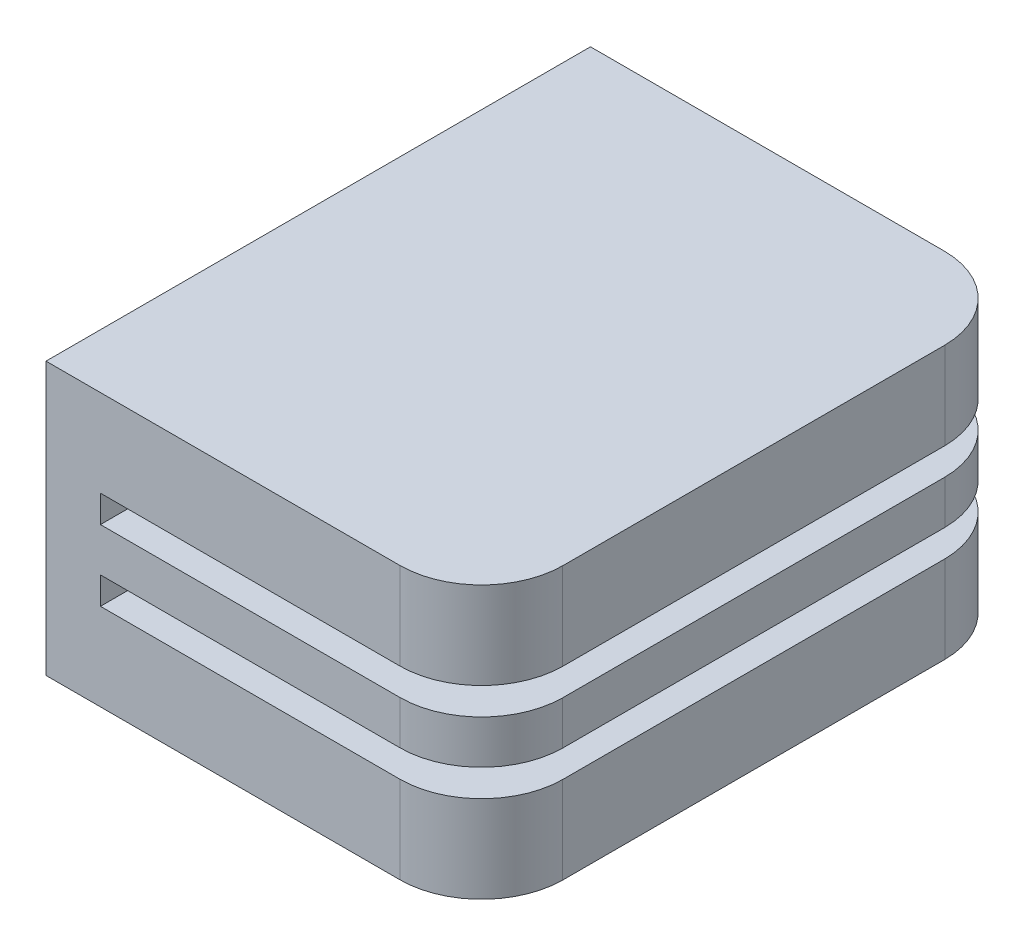
ISO-10303-21;
HEADER;
FILE_DESCRIPTION(('STEP AP214'),'2;1');
FILE_NAME('part.step','',(''),(''),'','','');
FILE_SCHEMA(('AUTOMOTIVE_DESIGN { 1 0 10303 214 1 1 1 1 }'));
ENDSEC;
DATA;
#1=APPLICATION_CONTEXT('core data for automotive mechanical design processes');
#2=APPLICATION_PROTOCOL_DEFINITION('international standard','automotive_design',2000,#1);
#3=PRODUCT_CONTEXT('',#1,'mechanical');
#4=PRODUCT('Part','Part','',(#3));
#5=PRODUCT_RELATED_PRODUCT_CATEGORY('part','',(#4));
#6=PRODUCT_DEFINITION_FORMATION('','',#4);
#7=PRODUCT_DEFINITION_CONTEXT('part definition',#1,'design');
#8=PRODUCT_DEFINITION('design','',#6,#7);
#9=PRODUCT_DEFINITION_SHAPE('','',#8);
#10=(LENGTH_UNIT() NAMED_UNIT(*) SI_UNIT(.MILLI.,.METRE.));
#11=(NAMED_UNIT(*) PLANE_ANGLE_UNIT() SI_UNIT($,.RADIAN.));
#12=(NAMED_UNIT(*) SI_UNIT($,.STERADIAN.) SOLID_ANGLE_UNIT());
#13=UNCERTAINTY_MEASURE_WITH_UNIT(LENGTH_MEASURE(1.E-05),#10,'distance_accuracy_value','');
#14=(GEOMETRIC_REPRESENTATION_CONTEXT(3) GLOBAL_UNCERTAINTY_ASSIGNED_CONTEXT((#13)) GLOBAL_UNIT_ASSIGNED_CONTEXT((#10,
#11,#12)) REPRESENTATION_CONTEXT('',''));
#15=CARTESIAN_POINT('',(0.,0.,0.));
#16=DIRECTION('',(0.,0.,1.));
#17=DIRECTION('',(1.,0.,0.));
#18=AXIS2_PLACEMENT_3D('',#15,#16,#17);
#19=CARTESIAN_POINT('',(4.,-5.,-5.));
#20=DIRECTION('',(0.,0.,-1.));
#21=DIRECTION('',(-1.,0.,0.));
#22=AXIS2_PLACEMENT_3D('',#19,#20,#21);
#23=PLANE('',#22);
#24=DIRECTION('',(-1.,0.,0.));
#25=VECTOR('',#24,1.);
#26=CARTESIAN_POINT('',(4.,0.,-5.));
#27=LINE('',#26,#25);
#28=CARTESIAN_POINT('',(2.50003341576897,0.,-5.));
#29=VERTEX_POINT('',#28);
#30=CARTESIAN_POINT('',(-4.,0.,-5.));
#31=VERTEX_POINT('',#30);
#32=EDGE_CURVE('E185',#29,#31,#27,.T.);
#33=ORIENTED_EDGE('',*,*,#32,.F.);
#34=DIRECTION('',(0.,1.,0.));
#35=VECTOR('',#34,1.);
#36=CARTESIAN_POINT('',(2.50003341576897,-5.,-5.));
#37=LINE('',#36,#35);
#38=CARTESIAN_POINT('',(2.50003341576897,-1.6,-5.));
#39=VERTEX_POINT('',#38);
#40=EDGE_CURVE('E291',#39,#29,#37,.T.);
#41=ORIENTED_EDGE('',*,*,#40,.F.);
#42=DIRECTION('',(1.,0.,0.));
#43=VECTOR('',#42,1.);
#44=CARTESIAN_POINT('',(4.,-1.6,-5.));
#45=LINE('',#44,#43);
#46=CARTESIAN_POINT('',(-3.,-1.6,-5.));
#47=VERTEX_POINT('',#46);
#48=EDGE_CURVE('E251',#47,#39,#45,.T.);
#49=ORIENTED_EDGE('',*,*,#48,.F.);
#50=DIRECTION('',(0.,1.,0.));
#51=VECTOR('',#50,1.);
#52=CARTESIAN_POINT('',(-3.,-1.6,-5.));
#53=LINE('',#52,#51);
#54=CARTESIAN_POINT('',(-3.,-2.1,-5.));
#55=VERTEX_POINT('',#54);
#56=EDGE_CURVE('E248',#55,#47,#53,.T.);
#57=ORIENTED_EDGE('',*,*,#56,.F.);
#58=DIRECTION('',(-1.,0.,0.));
#59=VECTOR('',#58,1.);
#60=CARTESIAN_POINT('',(-3.,-2.1,-5.));
#61=LINE('',#60,#59);
#62=CARTESIAN_POINT('',(2.50003341576897,-2.1,-5.));
#63=VERTEX_POINT('',#62);
#64=EDGE_CURVE('E246',#63,#55,#61,.T.);
#65=ORIENTED_EDGE('',*,*,#64,.F.);
#66=CARTESIAN_POINT('',(2.50003341576897,-2.9,-5.));
#67=VERTEX_POINT('',#66);
#68=EDGE_CURVE('E294',#67,#63,#37,.T.);
#69=ORIENTED_EDGE('',*,*,#68,.F.);
#70=DIRECTION('',(1.,0.,0.));
#71=VECTOR('',#70,1.);
#72=CARTESIAN_POINT('',(-3.,-2.9,-5.));
#73=LINE('',#72,#71);
#74=CARTESIAN_POINT('',(-3.,-2.9,-5.));
#75=VERTEX_POINT('',#74);
#76=EDGE_CURVE('E225',#75,#67,#73,.T.);
#77=ORIENTED_EDGE('',*,*,#76,.F.);
#78=DIRECTION('',(0.,1.,0.));
#79=VECTOR('',#78,1.);
#80=CARTESIAN_POINT('',(-3.,-3.4,-5.));
#81=LINE('',#80,#79);
#82=CARTESIAN_POINT('',(-3.,-3.4,-5.));
#83=VERTEX_POINT('',#82);
#84=EDGE_CURVE('E224',#83,#75,#81,.T.);
#85=ORIENTED_EDGE('',*,*,#84,.F.);
#86=DIRECTION('',(-1.,0.,0.));
#87=VECTOR('',#86,1.);
#88=CARTESIAN_POINT('',(4.,-3.4,-5.));
#89=LINE('',#88,#87);
#90=CARTESIAN_POINT('',(2.50003341576897,-3.4,-5.));
#91=VERTEX_POINT('',#90);
#92=EDGE_CURVE('E209',#91,#83,#89,.T.);
#93=ORIENTED_EDGE('',*,*,#92,.F.);
#94=CARTESIAN_POINT('',(2.50003341576897,-5.,-5.));
#95=VERTEX_POINT('',#94);
#96=EDGE_CURVE('E220',#95,#91,#37,.T.);
#97=ORIENTED_EDGE('',*,*,#96,.F.);
#98=DIRECTION('',(-1.,0.,0.));
#99=VECTOR('',#98,1.);
#100=CARTESIAN_POINT('',(4.,-5.,-5.));
#101=LINE('',#100,#99);
#102=CARTESIAN_POINT('',(-4.,-5.,-5.));
#103=VERTEX_POINT('',#102);
#104=EDGE_CURVE('E183',#95,#103,#101,.T.);
#105=ORIENTED_EDGE('',*,*,#104,.T.);
#106=DIRECTION('',(0.,1.,0.));
#107=VECTOR('',#106,1.);
#108=CARTESIAN_POINT('',(-4.,-5.,-5.));
#109=LINE('',#108,#107);
#110=EDGE_CURVE('E200',#103,#31,#109,.T.);
#111=ORIENTED_EDGE('',*,*,#110,.T.);
#112=EDGE_LOOP('',(#33,#41,#49,#57,#65,#69,#77,#85,#93,#97,#105,#111));
#113=FACE_BOUND('',#112,.T.);
#114=ADVANCED_FACE('F33',(#113),#23,.T.);
#115=CARTESIAN_POINT('',(4.,-5.,5.));
#116=DIRECTION('',(1.,0.,0.));
#117=DIRECTION('',(0.,0.,-1.));
#118=AXIS2_PLACEMENT_3D('',#115,#116,#117);
#119=PLANE('',#118);
#120=DIRECTION('',(0.,1.,0.));
#121=VECTOR('',#120,1.);
#122=CARTESIAN_POINT('',(4.,-5.,3.51001230194758));
#123=LINE('',#122,#121);
#124=CARTESIAN_POINT('',(4.,-2.9,3.51001230194758));
#125=VERTEX_POINT('',#124);
#126=CARTESIAN_POINT('',(4.,-2.1,3.51001230194758));
#127=VERTEX_POINT('',#126);
#128=EDGE_CURVE('E338',#125,#127,#123,.T.);
#129=ORIENTED_EDGE('',*,*,#128,.F.);
#130=DIRECTION('',(0.,0.,-1.));
#131=VECTOR('',#130,1.);
#132=CARTESIAN_POINT('',(4.,-2.9,5.001));
#133=LINE('',#132,#131);
#134=CARTESIAN_POINT('',(4.,-2.9,-3.5100123019476));
#135=VERTEX_POINT('',#134);
#136=EDGE_CURVE('E227',#125,#135,#133,.T.);
#137=ORIENTED_EDGE('',*,*,#136,.T.);
#138=DIRECTION('',(0.,1.,0.));
#139=VECTOR('',#138,1.);
#140=CARTESIAN_POINT('',(4.,-5.,-3.51001230194759));
#141=LINE('',#140,#139);
#142=CARTESIAN_POINT('',(4.,-2.1,-3.51001230194759));
#143=VERTEX_POINT('',#142);
#144=EDGE_CURVE('E302',#135,#143,#141,.T.);
#145=ORIENTED_EDGE('',*,*,#144,.T.);
#146=DIRECTION('',(0.,0.,-1.));
#147=VECTOR('',#146,1.);
#148=CARTESIAN_POINT('',(4.,-2.1,5.001));
#149=LINE('',#148,#147);
#150=EDGE_CURVE('E254',#127,#143,#149,.T.);
#151=ORIENTED_EDGE('',*,*,#150,.F.);
#152=EDGE_LOOP('',(#129,#137,#145,#151));
#153=FACE_BOUND('',#152,.T.);
#154=ADVANCED_FACE('F337',(#153),#119,.T.);
#155=CARTESIAN_POINT('',(4.,-1.6,3.51001230194758));
#156=VERTEX_POINT('',#155);
#157=CARTESIAN_POINT('',(4.,0.,3.51001230194758));
#158=VERTEX_POINT('',#157);
#159=EDGE_CURVE('E165',#156,#158,#123,.T.);
#160=ORIENTED_EDGE('',*,*,#159,.F.);
#161=DIRECTION('',(0.,0.,-1.));
#162=VECTOR('',#161,1.);
#163=CARTESIAN_POINT('',(4.,-1.6,5.001));
#164=LINE('',#163,#162);
#165=CARTESIAN_POINT('',(4.,-1.6,-3.5100123019476));
#166=VERTEX_POINT('',#165);
#167=EDGE_CURVE('E255',#156,#166,#164,.T.);
#168=ORIENTED_EDGE('',*,*,#167,.T.);
#169=CARTESIAN_POINT('',(4.,0.,-3.51001230194759));
#170=VERTEX_POINT('',#169);
#171=EDGE_CURVE('E300',#166,#170,#141,.T.);
#172=ORIENTED_EDGE('',*,*,#171,.T.);
#173=DIRECTION('',(0.,0.,-1.));
#174=VECTOR('',#173,1.);
#175=CARTESIAN_POINT('',(4.,0.,5.));
#176=LINE('',#175,#174);
#177=EDGE_CURVE('E197',#158,#170,#176,.T.);
#178=ORIENTED_EDGE('',*,*,#177,.F.);
#179=EDGE_LOOP('',(#160,#168,#172,#178));
#180=FACE_BOUND('',#179,.T.);
#181=ADVANCED_FACE('F347',(#180),#119,.T.);
#182=CARTESIAN_POINT('',(-4.,-5.,5.));
#183=DIRECTION('',(-1.,0.,0.));
#184=DIRECTION('',(0.,0.,1.));
#185=AXIS2_PLACEMENT_3D('',#182,#183,#184);
#186=PLANE('',#185);
#187=DIRECTION('',(0.,0.,1.));
#188=VECTOR('',#187,1.);
#189=CARTESIAN_POINT('',(-4.,0.,5.));
#190=LINE('',#189,#188);
#191=CARTESIAN_POINT('',(-4.,0.,5.));
#192=VERTEX_POINT('',#191);
#193=EDGE_CURVE('E190',#31,#192,#190,.T.);
#194=ORIENTED_EDGE('',*,*,#193,.F.);
#195=ORIENTED_EDGE('',*,*,#110,.F.);
#196=DIRECTION('',(0.,0.,1.));
#197=VECTOR('',#196,1.);
#198=CARTESIAN_POINT('',(-4.,-5.,5.));
#199=LINE('',#198,#197);
#200=CARTESIAN_POINT('',(-4.,-5.,5.));
#201=VERTEX_POINT('',#200);
#202=EDGE_CURVE('E181',#103,#201,#199,.T.);
#203=ORIENTED_EDGE('',*,*,#202,.T.);
#204=DIRECTION('',(0.,1.,0.));
#205=VECTOR('',#204,1.);
#206=CARTESIAN_POINT('',(-4.,-5.,5.));
#207=LINE('',#206,#205);
#208=EDGE_CURVE('E180',#201,#192,#207,.T.);
#209=ORIENTED_EDGE('',*,*,#208,.T.);
#210=EDGE_LOOP('',(#194,#195,#203,#209));
#211=FACE_BOUND('',#210,.T.);
#212=ADVANCED_FACE('F35',(#211),#186,.T.);
#213=CARTESIAN_POINT('',(4.,-5.,3.51001230194758));
#214=VERTEX_POINT('',#213);
#215=CARTESIAN_POINT('',(4.,-3.4,3.51001230194758));
#216=VERTEX_POINT('',#215);
#217=EDGE_CURVE('E339',#214,#216,#123,.T.);
#218=ORIENTED_EDGE('',*,*,#217,.F.);
#219=DIRECTION('',(0.,0.,-1.));
#220=VECTOR('',#219,1.);
#221=CARTESIAN_POINT('',(4.,-5.,5.));
#222=LINE('',#221,#220);
#223=CARTESIAN_POINT('',(4.,-5.,-3.51001230194759));
#224=VERTEX_POINT('',#223);
#225=EDGE_CURVE('E175',#214,#224,#222,.T.);
#226=ORIENTED_EDGE('',*,*,#225,.T.);
#227=CARTESIAN_POINT('',(4.,-3.4,-3.51001230194759));
#228=VERTEX_POINT('',#227);
#229=EDGE_CURVE('E303',#224,#228,#141,.T.);
#230=ORIENTED_EDGE('',*,*,#229,.T.);
#231=DIRECTION('',(0.,0.,-1.));
#232=VECTOR('',#231,1.);
#233=CARTESIAN_POINT('',(4.,-3.4,5.001));
#234=LINE('',#233,#232);
#235=EDGE_CURVE('E212',#216,#228,#234,.T.);
#236=ORIENTED_EDGE('',*,*,#235,.F.);
#237=EDGE_LOOP('',(#218,#226,#230,#236));
#238=FACE_BOUND('',#237,.T.);
#239=ADVANCED_FACE('F363',(#238),#119,.T.);
#240=CARTESIAN_POINT('',(4.,-5.,5.));
#241=DIRECTION('',(0.,0.,1.));
#242=DIRECTION('',(1.,0.,0.));
#243=AXIS2_PLACEMENT_3D('',#240,#241,#242);
#244=PLANE('',#243);
#245=DIRECTION('',(0.,1.,0.));
#246=VECTOR('',#245,1.);
#247=CARTESIAN_POINT('',(2.50003341576897,-5.,5.));
#248=LINE('',#247,#246);
#249=CARTESIAN_POINT('',(2.50003341576897,-1.6,5.));
#250=VERTEX_POINT('',#249);
#251=CARTESIAN_POINT('',(2.50003341576897,0.,5.));
#252=VERTEX_POINT('',#251);
#253=EDGE_CURVE('E48',#250,#252,#248,.T.);
#254=ORIENTED_EDGE('',*,*,#253,.T.);
#255=DIRECTION('',(1.,0.,0.));
#256=VECTOR('',#255,1.);
#257=CARTESIAN_POINT('',(4.,0.,5.));
#258=LINE('',#257,#256);
#259=EDGE_CURVE('E193',#192,#252,#258,.T.);
#260=ORIENTED_EDGE('',*,*,#259,.F.);
#261=ORIENTED_EDGE('',*,*,#208,.F.);
#262=DIRECTION('',(1.,0.,0.));
#263=VECTOR('',#262,1.);
#264=CARTESIAN_POINT('',(4.,-5.,5.));
#265=LINE('',#264,#263);
#266=CARTESIAN_POINT('',(2.50003341576897,-5.,5.));
#267=VERTEX_POINT('',#266);
#268=EDGE_CURVE('E172',#201,#267,#265,.T.);
#269=ORIENTED_EDGE('',*,*,#268,.T.);
#270=CARTESIAN_POINT('',(2.50003341576897,-3.4,5.));
#271=VERTEX_POINT('',#270);
#272=EDGE_CURVE('E157',#267,#271,#248,.T.);
#273=ORIENTED_EDGE('',*,*,#272,.T.);
#274=DIRECTION('',(-1.,0.,0.));
#275=VECTOR('',#274,1.);
#276=CARTESIAN_POINT('',(4.,-3.4,5.));
#277=LINE('',#276,#275);
#278=CARTESIAN_POINT('',(-3.,-3.4,5.));
#279=VERTEX_POINT('',#278);
#280=EDGE_CURVE('E318',#271,#279,#277,.T.);
#281=ORIENTED_EDGE('',*,*,#280,.T.);
#282=DIRECTION('',(0.,1.,0.));
#283=VECTOR('',#282,1.);
#284=CARTESIAN_POINT('',(-3.,-3.4,5.));
#285=LINE('',#284,#283);
#286=CARTESIAN_POINT('',(-3.,-2.9,5.));
#287=VERTEX_POINT('',#286);
#288=EDGE_CURVE('E320',#279,#287,#285,.T.);
#289=ORIENTED_EDGE('',*,*,#288,.T.);
#290=DIRECTION('',(1.,0.,0.));
#291=VECTOR('',#290,1.);
#292=CARTESIAN_POINT('',(-3.,-2.9,5.));
#293=LINE('',#292,#291);
#294=CARTESIAN_POINT('',(2.50003341576897,-2.9,5.));
#295=VERTEX_POINT('',#294);
#296=EDGE_CURVE('E230',#287,#295,#293,.T.);
#297=ORIENTED_EDGE('',*,*,#296,.T.);
#298=CARTESIAN_POINT('',(2.50003341576897,-2.1,5.));
#299=VERTEX_POINT('',#298);
#300=EDGE_CURVE('E56',#295,#299,#248,.T.);
#301=ORIENTED_EDGE('',*,*,#300,.T.);
#302=DIRECTION('',(-1.,0.,0.));
#303=VECTOR('',#302,1.);
#304=CARTESIAN_POINT('',(-3.,-2.1,5.));
#305=LINE('',#304,#303);
#306=CARTESIAN_POINT('',(-3.,-2.1,5.));
#307=VERTEX_POINT('',#306);
#308=EDGE_CURVE('E194',#299,#307,#305,.T.);
#309=ORIENTED_EDGE('',*,*,#308,.T.);
#310=DIRECTION('',(0.,1.,0.));
#311=VECTOR('',#310,1.);
#312=CARTESIAN_POINT('',(-3.,-1.6,5.));
#313=LINE('',#312,#311);
#314=CARTESIAN_POINT('',(-3.,-1.6,5.));
#315=VERTEX_POINT('',#314);
#316=EDGE_CURVE('E236',#307,#315,#313,.T.);
#317=ORIENTED_EDGE('',*,*,#316,.T.);
#318=DIRECTION('',(1.,0.,0.));
#319=VECTOR('',#318,1.);
#320=CARTESIAN_POINT('',(4.,-1.6,5.));
#321=LINE('',#320,#319);
#322=EDGE_CURVE('E243',#315,#250,#321,.T.);
#323=ORIENTED_EDGE('',*,*,#322,.T.);
#324=EDGE_LOOP('',(#254,#260,#261,#269,#273,#281,#289,#297,#301,#309,#317,#323));
#325=FACE_BOUND('',#324,.T.);
#326=ADVANCED_FACE('F178',(#325),#244,.T.);
#327=CARTESIAN_POINT('',(0.,-5.,0.));
#328=DIRECTION('',(0.,1.,0.));
#329=DIRECTION('',(0.,0.,1.));
#330=AXIS2_PLACEMENT_3D('',#327,#328,#329);
#331=PLANE('',#330);
#332=ORIENTED_EDGE('',*,*,#225,.F.);
#333=CARTESIAN_POINT('',(2.50003341576897,-5.,3.5));
#334=DIRECTION('',(0.,-1.,0.));
#335=DIRECTION('',(0.,0.,1.));
#336=AXIS2_PLACEMENT_3D('',#333,#334,#335);
#337=CIRCLE('',#336,1.5);
#338=EDGE_CURVE('E160',#214,#267,#337,.T.);
#339=ORIENTED_EDGE('',*,*,#338,.T.);
#340=ORIENTED_EDGE('',*,*,#268,.F.);
#341=ORIENTED_EDGE('',*,*,#202,.F.);
#342=ORIENTED_EDGE('',*,*,#104,.F.);
#343=CARTESIAN_POINT('',(2.50003341576897,-5.,-3.5));
#344=DIRECTION('',(0.,-1.,0.));
#345=DIRECTION('',(0.,0.,-1.));
#346=AXIS2_PLACEMENT_3D('',#343,#344,#345);
#347=CIRCLE('',#346,1.5);
#348=EDGE_CURVE('E289',#95,#224,#347,.T.);
#349=ORIENTED_EDGE('',*,*,#348,.T.);
#350=EDGE_LOOP('',(#332,#339,#340,#341,#342,#349));
#351=FACE_BOUND('',#350,.T.);
#352=ADVANCED_FACE('F170',(#351),#331,.F.);
#353=CARTESIAN_POINT('',(0.,0.,0.));
#354=DIRECTION('',(0.,1.,0.));
#355=DIRECTION('',(0.,0.,1.));
#356=AXIS2_PLACEMENT_3D('',#353,#354,#355);
#357=PLANE('',#356);
#358=CARTESIAN_POINT('',(2.50003341576897,0.,3.5));
#359=DIRECTION('',(0.,-1.,0.));
#360=DIRECTION('',(0.,0.,1.));
#361=AXIS2_PLACEMENT_3D('',#358,#359,#360);
#362=CIRCLE('',#361,1.5);
#363=EDGE_CURVE('E176',#158,#252,#362,.T.);
#364=ORIENTED_EDGE('',*,*,#363,.F.);
#365=ORIENTED_EDGE('',*,*,#177,.T.);
#366=CARTESIAN_POINT('',(2.50003341576897,0.,-3.5));
#367=DIRECTION('',(0.,-1.,0.));
#368=DIRECTION('',(0.,0.,-1.));
#369=AXIS2_PLACEMENT_3D('',#366,#367,#368);
#370=CIRCLE('',#369,1.5);
#371=EDGE_CURVE('E296',#29,#170,#370,.T.);
#372=ORIENTED_EDGE('',*,*,#371,.F.);
#373=ORIENTED_EDGE('',*,*,#32,.T.);
#374=ORIENTED_EDGE('',*,*,#193,.T.);
#375=ORIENTED_EDGE('',*,*,#259,.T.);
#376=EDGE_LOOP('',(#364,#365,#372,#373,#374,#375));
#377=FACE_BOUND('',#376,.T.);
#378=ADVANCED_FACE('F283',(#377),#357,.T.);
#379=CARTESIAN_POINT('',(4.,-1.6,5.001));
#380=DIRECTION('',(0.,1.,0.));
#381=DIRECTION('',(0.,0.,1.));
#382=AXIS2_PLACEMENT_3D('',#379,#380,#381);
#383=PLANE('',#382);
#384=ORIENTED_EDGE('',*,*,#167,.F.);
#385=CARTESIAN_POINT('',(2.50003341576897,-1.6,3.5));
#386=DIRECTION('',(0.,1.,0.));
#387=DIRECTION('',(0.,0.,1.));
#388=AXIS2_PLACEMENT_3D('',#385,#386,#387);
#389=CIRCLE('',#388,1.5);
#390=EDGE_CURVE('E280',#156,#250,#389,.F.);
#391=ORIENTED_EDGE('',*,*,#390,.T.);
#392=ORIENTED_EDGE('',*,*,#322,.F.);
#393=DIRECTION('',(0.,0.,-1.));
#394=VECTOR('',#393,1.);
#395=CARTESIAN_POINT('',(-3.,-1.6,5.001));
#396=LINE('',#395,#394);
#397=EDGE_CURVE('E257',#315,#47,#396,.T.);
#398=ORIENTED_EDGE('',*,*,#397,.T.);
#399=ORIENTED_EDGE('',*,*,#48,.T.);
#400=CARTESIAN_POINT('',(2.50003341576897,-1.6,-3.5));
#401=DIRECTION('',(0.,1.,0.));
#402=DIRECTION('',(0.,0.,1.));
#403=AXIS2_PLACEMENT_3D('',#400,#401,#402);
#404=CIRCLE('',#403,1.5);
#405=EDGE_CURVE('E314',#39,#166,#404,.F.);
#406=ORIENTED_EDGE('',*,*,#405,.T.);
#407=EDGE_LOOP('',(#384,#391,#392,#398,#399,#406));
#408=FACE_BOUND('',#407,.T.);
#409=ADVANCED_FACE('F278',(#408),#383,.F.);
#410=CARTESIAN_POINT('',(-3.,-1.6,5.001));
#411=DIRECTION('',(-1.,0.,0.));
#412=DIRECTION('',(0.,0.,1.));
#413=AXIS2_PLACEMENT_3D('',#410,#411,#412);
#414=PLANE('',#413);
#415=DIRECTION('',(0.,0.,-1.));
#416=VECTOR('',#415,1.);
#417=CARTESIAN_POINT('',(-3.,-2.1,5.001));
#418=LINE('',#417,#416);
#419=EDGE_CURVE('E259',#307,#55,#418,.T.);
#420=ORIENTED_EDGE('',*,*,#419,.T.);
#421=ORIENTED_EDGE('',*,*,#56,.T.);
#422=ORIENTED_EDGE('',*,*,#397,.F.);
#423=ORIENTED_EDGE('',*,*,#316,.F.);
#424=EDGE_LOOP('',(#420,#421,#422,#423));
#425=FACE_BOUND('',#424,.T.);
#426=ADVANCED_FACE('F274',(#425),#414,.F.);
#427=CARTESIAN_POINT('',(-3.,-2.1,5.001));
#428=DIRECTION('',(0.,-1.,0.));
#429=DIRECTION('',(1.,0.,0.));
#430=AXIS2_PLACEMENT_3D('',#427,#428,#429);
#431=PLANE('',#430);
#432=ORIENTED_EDGE('',*,*,#308,.F.);
#433=CARTESIAN_POINT('',(2.50003341576897,-2.1,3.5));
#434=DIRECTION('',(0.,-1.,0.));
#435=DIRECTION('',(1.,0.,0.));
#436=AXIS2_PLACEMENT_3D('',#433,#434,#435);
#437=CIRCLE('',#436,1.5);
#438=EDGE_CURVE('E334',#299,#127,#437,.F.);
#439=ORIENTED_EDGE('',*,*,#438,.T.);
#440=ORIENTED_EDGE('',*,*,#150,.T.);
#441=CARTESIAN_POINT('',(2.50003341576897,-2.1,-3.5));
#442=DIRECTION('',(0.,-1.,0.));
#443=DIRECTION('',(1.,0.,0.));
#444=AXIS2_PLACEMENT_3D('',#441,#442,#443);
#445=CIRCLE('',#444,1.5);
#446=EDGE_CURVE('E311',#143,#63,#445,.F.);
#447=ORIENTED_EDGE('',*,*,#446,.T.);
#448=ORIENTED_EDGE('',*,*,#64,.T.);
#449=ORIENTED_EDGE('',*,*,#419,.F.);
#450=EDGE_LOOP('',(#432,#439,#440,#447,#448,#449));
#451=FACE_BOUND('',#450,.T.);
#452=ADVANCED_FACE('F268',(#451),#431,.F.);
#453=CARTESIAN_POINT('',(-3.,-2.9,5.001));
#454=DIRECTION('',(0.,1.,0.));
#455=DIRECTION('',(-1.,0.,0.));
#456=AXIS2_PLACEMENT_3D('',#453,#454,#455);
#457=PLANE('',#456);
#458=ORIENTED_EDGE('',*,*,#136,.F.);
#459=CARTESIAN_POINT('',(2.50003341576897,-2.9,3.5));
#460=DIRECTION('',(0.,1.,0.));
#461=DIRECTION('',(-1.,0.,0.));
#462=AXIS2_PLACEMENT_3D('',#459,#460,#461);
#463=CIRCLE('',#462,1.5);
#464=EDGE_CURVE('E325',#125,#295,#463,.F.);
#465=ORIENTED_EDGE('',*,*,#464,.T.);
#466=ORIENTED_EDGE('',*,*,#296,.F.);
#467=DIRECTION('',(0.,0.,-1.));
#468=VECTOR('',#467,1.);
#469=CARTESIAN_POINT('',(-3.,-2.9,5.001));
#470=LINE('',#469,#468);
#471=EDGE_CURVE('E234',#287,#75,#470,.T.);
#472=ORIENTED_EDGE('',*,*,#471,.T.);
#473=ORIENTED_EDGE('',*,*,#76,.T.);
#474=CARTESIAN_POINT('',(2.50003341576897,-2.9,-3.5));
#475=DIRECTION('',(0.,1.,0.));
#476=DIRECTION('',(-1.,0.,0.));
#477=AXIS2_PLACEMENT_3D('',#474,#475,#476);
#478=CIRCLE('',#477,1.5);
#479=EDGE_CURVE('E308',#67,#135,#478,.F.);
#480=ORIENTED_EDGE('',*,*,#479,.T.);
#481=EDGE_LOOP('',(#458,#465,#466,#472,#473,#480));
#482=FACE_BOUND('',#481,.T.);
#483=ADVANCED_FACE('F324',(#482),#457,.F.);
#484=CARTESIAN_POINT('',(-3.,-3.4,5.001));
#485=DIRECTION('',(-1.,0.,0.));
#486=DIRECTION('',(0.,0.,1.));
#487=AXIS2_PLACEMENT_3D('',#484,#485,#486);
#488=PLANE('',#487);
#489=DIRECTION('',(0.,0.,-1.));
#490=VECTOR('',#489,1.);
#491=CARTESIAN_POINT('',(-3.,-3.4,5.001));
#492=LINE('',#491,#490);
#493=EDGE_CURVE('E237',#279,#83,#492,.T.);
#494=ORIENTED_EDGE('',*,*,#493,.T.);
#495=ORIENTED_EDGE('',*,*,#84,.T.);
#496=ORIENTED_EDGE('',*,*,#471,.F.);
#497=ORIENTED_EDGE('',*,*,#288,.F.);
#498=EDGE_LOOP('',(#494,#495,#496,#497));
#499=FACE_BOUND('',#498,.T.);
#500=ADVANCED_FACE('F327',(#499),#488,.F.);
#501=CARTESIAN_POINT('',(4.,-3.4,5.001));
#502=DIRECTION('',(0.,-1.,0.));
#503=DIRECTION('',(0.,0.,-1.));
#504=AXIS2_PLACEMENT_3D('',#501,#502,#503);
#505=PLANE('',#504);
#506=ORIENTED_EDGE('',*,*,#280,.F.);
#507=CARTESIAN_POINT('',(2.50003341576897,-3.4,3.5));
#508=DIRECTION('',(0.,-1.,0.));
#509=DIRECTION('',(0.,0.,-1.));
#510=AXIS2_PLACEMENT_3D('',#507,#508,#509);
#511=CIRCLE('',#510,1.5);
#512=EDGE_CURVE('E11',#271,#216,#511,.F.);
#513=ORIENTED_EDGE('',*,*,#512,.T.);
#514=ORIENTED_EDGE('',*,*,#235,.T.);
#515=CARTESIAN_POINT('',(2.50003341576897,-3.4,-3.5));
#516=DIRECTION('',(0.,-1.,0.));
#517=DIRECTION('',(0.,0.,-1.));
#518=AXIS2_PLACEMENT_3D('',#515,#516,#517);
#519=CIRCLE('',#518,1.5);
#520=EDGE_CURVE('E41',#228,#91,#519,.F.);
#521=ORIENTED_EDGE('',*,*,#520,.T.);
#522=ORIENTED_EDGE('',*,*,#92,.T.);
#523=ORIENTED_EDGE('',*,*,#493,.F.);
#524=EDGE_LOOP('',(#506,#513,#514,#521,#522,#523));
#525=FACE_BOUND('',#524,.T.);
#526=ADVANCED_FACE('F207',(#525),#505,.F.);
#527=CARTESIAN_POINT('',(2.50003341576897,-5.,-3.5));
#528=DIRECTION('',(0.,1.,0.));
#529=DIRECTION('',(0.,0.,1.));
#530=AXIS2_PLACEMENT_3D('',#527,#528,#529);
#531=CYLINDRICAL_SURFACE('',#530,1.5);
#532=ORIENTED_EDGE('',*,*,#229,.F.);
#533=ORIENTED_EDGE('',*,*,#348,.F.);
#534=ORIENTED_EDGE('',*,*,#96,.T.);
#535=ORIENTED_EDGE('',*,*,#520,.F.);
#536=EDGE_LOOP('',(#532,#533,#534,#535));
#537=FACE_BOUND('',#536,.T.);
#538=ADVANCED_FACE('F385',(#537),#531,.T.);
#539=ORIENTED_EDGE('',*,*,#144,.F.);
#540=ORIENTED_EDGE('',*,*,#479,.F.);
#541=ORIENTED_EDGE('',*,*,#68,.T.);
#542=ORIENTED_EDGE('',*,*,#446,.F.);
#543=EDGE_LOOP('',(#539,#540,#541,#542));
#544=FACE_BOUND('',#543,.T.);
#545=ADVANCED_FACE('F332',(#544),#531,.T.);
#546=ORIENTED_EDGE('',*,*,#40,.T.);
#547=ORIENTED_EDGE('',*,*,#371,.T.);
#548=ORIENTED_EDGE('',*,*,#171,.F.);
#549=ORIENTED_EDGE('',*,*,#405,.F.);
#550=EDGE_LOOP('',(#546,#547,#548,#549));
#551=FACE_BOUND('',#550,.T.);
#552=ADVANCED_FACE('F345',(#551),#531,.T.);
#553=CARTESIAN_POINT('',(2.50003341576897,-5.,3.5));
#554=DIRECTION('',(0.,1.,0.));
#555=DIRECTION('',(0.,0.,1.));
#556=AXIS2_PLACEMENT_3D('',#553,#554,#555);
#557=CYLINDRICAL_SURFACE('',#556,1.5);
#558=ORIENTED_EDGE('',*,*,#272,.F.);
#559=ORIENTED_EDGE('',*,*,#338,.F.);
#560=ORIENTED_EDGE('',*,*,#217,.T.);
#561=ORIENTED_EDGE('',*,*,#512,.F.);
#562=EDGE_LOOP('',(#558,#559,#560,#561));
#563=FACE_BOUND('',#562,.T.);
#564=ADVANCED_FACE('F159',(#563),#557,.T.);
#565=ORIENTED_EDGE('',*,*,#300,.F.);
#566=ORIENTED_EDGE('',*,*,#464,.F.);
#567=ORIENTED_EDGE('',*,*,#128,.T.);
#568=ORIENTED_EDGE('',*,*,#438,.F.);
#569=EDGE_LOOP('',(#565,#566,#567,#568));
#570=FACE_BOUND('',#569,.T.);
#571=ADVANCED_FACE('F350',(#570),#557,.T.);
#572=ORIENTED_EDGE('',*,*,#159,.T.);
#573=ORIENTED_EDGE('',*,*,#363,.T.);
#574=ORIENTED_EDGE('',*,*,#253,.F.);
#575=ORIENTED_EDGE('',*,*,#390,.F.);
#576=EDGE_LOOP('',(#572,#573,#574,#575));
#577=FACE_BOUND('',#576,.T.);
#578=ADVANCED_FACE('F348',(#577),#557,.T.);
#579=CLOSED_SHELL('',(#114,#154,#181,#212,#239,#326,#352,#378,#409,#426,#452,#483,#500,#526,
#538,#545,#552,#564,#571,#578));
#580=MANIFOLD_SOLID_BREP('B2',#579);
#581=ADVANCED_BREP_SHAPE_REPRESENTATION('',(#18,#580),#14);
#582=SHAPE_DEFINITION_REPRESENTATION(#9,#581);
ENDSEC;
END-ISO-10303-21;
